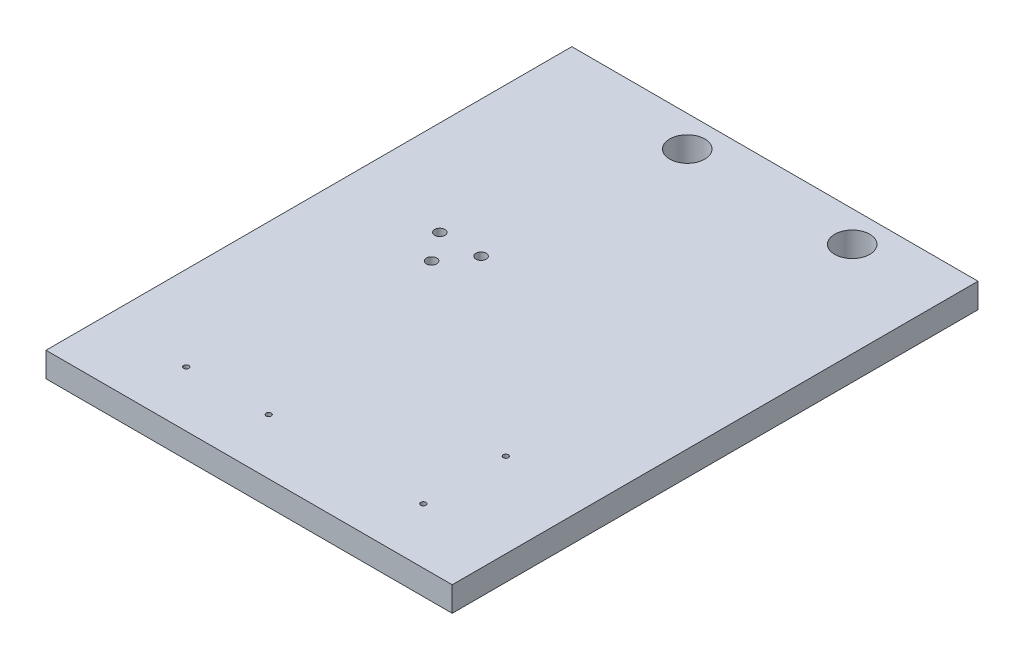
ISO-10303-21;
HEADER;
FILE_DESCRIPTION(('STEP AP214'),'2;1');
FILE_NAME('part.step','',(''),(''),'','','');
FILE_SCHEMA(('AUTOMOTIVE_DESIGN { 1 0 10303 214 1 1 1 1 }'));
ENDSEC;
DATA;
#1=APPLICATION_CONTEXT('core data for automotive mechanical design processes');
#2=APPLICATION_PROTOCOL_DEFINITION('international standard','automotive_design',2000,#1);
#3=PRODUCT_CONTEXT('',#1,'mechanical');
#4=PRODUCT('Part','Part','',(#3));
#5=PRODUCT_RELATED_PRODUCT_CATEGORY('part','',(#4));
#6=PRODUCT_DEFINITION_FORMATION('','',#4);
#7=PRODUCT_DEFINITION_CONTEXT('part definition',#1,'design');
#8=PRODUCT_DEFINITION('design','',#6,#7);
#9=PRODUCT_DEFINITION_SHAPE('','',#8);
#10=(LENGTH_UNIT() NAMED_UNIT(*) SI_UNIT(.MILLI.,.METRE.));
#11=(NAMED_UNIT(*) PLANE_ANGLE_UNIT() SI_UNIT($,.RADIAN.));
#12=(NAMED_UNIT(*) SI_UNIT($,.STERADIAN.) SOLID_ANGLE_UNIT());
#13=UNCERTAINTY_MEASURE_WITH_UNIT(LENGTH_MEASURE(1.E-05),#10,'distance_accuracy_value','');
#14=(GEOMETRIC_REPRESENTATION_CONTEXT(3) GLOBAL_UNCERTAINTY_ASSIGNED_CONTEXT((#13)) GLOBAL_UNIT_ASSIGNED_CONTEXT((#10,
#11,#12)) REPRESENTATION_CONTEXT('',''));
#15=CARTESIAN_POINT('',(0.,0.,0.));
#16=DIRECTION('',(0.,0.,1.));
#17=DIRECTION('',(1.,0.,0.));
#18=AXIS2_PLACEMENT_3D('',#15,#16,#17);
#19=CARTESIAN_POINT('',(57.5,5.99999999997181,100.5));
#20=DIRECTION('',(0.,1.,0.));
#21=DIRECTION('',(0.,0.,1.));
#22=AXIS2_PLACEMENT_3D('',#19,#20,#21);
#23=CONICAL_SURFACE('',#22,1.24999999995953,1.0297442586752);
#24=CARTESIAN_POINT('',(57.5,6.,100.5));
#25=DIRECTION('',(0.,1.,0.));
#26=DIRECTION('',(0.,0.,1.));
#27=AXIS2_PLACEMENT_3D('',#24,#25,#26);
#28=CIRCLE('',#27,1.25);
#29=CARTESIAN_POINT('',(56.2500000000085,6.00000000000716,100.5));
#30=VERTEX_POINT('',#29);
#31=CARTESIAN_POINT('',(58.7499999999937,6.00000000000716,100.5));
#32=VERTEX_POINT('',#31);
#33=EDGE_CURVE('E120',#30,#32,#28,.T.);
#34=ORIENTED_EDGE('',*,*,#33,.T.);
#35=DIRECTION('',(-0.857167300703835,-0.515038074907187,0.));
#36=VECTOR('',#35,1.);
#37=CARTESIAN_POINT('',(498957.,299774.311324496,100.500000000031));
#38=LINE('',#37,#36);
#39=CARTESIAN_POINT('',(57.4999999999761,5.24892422626522,100.5));
#40=VERTEX_POINT('',#39);
#41=EDGE_CURVE('E113',#32,#40,#38,.T.);
#42=ORIENTED_EDGE('',*,*,#41,.T.);
#43=DIRECTION('',(0.857167300703835,-0.515038074907187,0.));
#44=VECTOR('',#43,1.);
#45=CARTESIAN_POINT('',(-498842.,299774.311324496,100.499999999908));
#46=LINE('',#45,#44);
#47=EDGE_CURVE('E110',#40,#30,#46,.F.);
#48=ORIENTED_EDGE('',*,*,#47,.T.);
#49=EDGE_LOOP('',(#34,#42,#48));
#50=FACE_BOUND('',#49,.T.);
#51=ADVANCED_FACE('F17',(#50),#23,.F.);
#52=CARTESIAN_POINT('',(57.5,6.00000000002865,100.5));
#53=DIRECTION('',(0.,1.,0.));
#54=DIRECTION('',(0.,0.,1.));
#55=AXIS2_PLACEMENT_3D('',#52,#53,#54);
#56=CONICAL_SURFACE('',#55,1.24999999998135,1.02974425866186);
#57=ORIENTED_EDGE('',*,*,#47,.F.);
#58=ORIENTED_EDGE('',*,*,#41,.F.);
#59=CARTESIAN_POINT('',(57.5,6.,100.5));
#60=DIRECTION('',(0.,1.,0.));
#61=DIRECTION('',(0.,0.,1.));
#62=AXIS2_PLACEMENT_3D('',#59,#60,#61);
#63=CIRCLE('',#62,1.25);
#64=EDGE_CURVE('E116',#32,#30,#63,.T.);
#65=ORIENTED_EDGE('',*,*,#64,.T.);
#66=EDGE_LOOP('',(#57,#58,#65));
#67=FACE_BOUND('',#66,.T.);
#68=ADVANCED_FACE('F112',(#67),#56,.F.);
#69=CARTESIAN_POINT('',(-17.5,5.99999999997181,100.5));
#70=DIRECTION('',(0.,1.,0.));
#71=DIRECTION('',(0.,0.,1.));
#72=AXIS2_PLACEMENT_3D('',#69,#70,#71);
#73=CONICAL_SURFACE('',#72,1.24999999995953,1.0297442586752);
#74=CARTESIAN_POINT('',(-17.5,6.,100.5));
#75=DIRECTION('',(0.,1.,0.));
#76=DIRECTION('',(0.,0.,1.));
#77=AXIS2_PLACEMENT_3D('',#74,#75,#76);
#78=CIRCLE('',#77,1.25);
#79=CARTESIAN_POINT('',(-18.7499999999886,6.00000000000716,100.5));
#80=VERTEX_POINT('',#79);
#81=CARTESIAN_POINT('',(-16.2500000000034,6.00000000000716,100.5));
#82=VERTEX_POINT('',#81);
#83=EDGE_CURVE('E247',#80,#82,#78,.T.);
#84=ORIENTED_EDGE('',*,*,#83,.T.);
#85=DIRECTION('',(-0.857167300703835,-0.515038074907187,0.));
#86=VECTOR('',#85,1.);
#87=CARTESIAN_POINT('',(498882.,299774.311324496,100.500000000031));
#88=LINE('',#87,#86);
#89=CARTESIAN_POINT('',(-17.5000000000125,5.24892422626522,100.5));
#90=VERTEX_POINT('',#89);
#91=EDGE_CURVE('E118',#82,#90,#88,.T.);
#92=ORIENTED_EDGE('',*,*,#91,.T.);
#93=DIRECTION('',(0.857167300703835,-0.515038074907187,0.));
#94=VECTOR('',#93,1.);
#95=CARTESIAN_POINT('',(-498917.,299774.311324496,100.499999999908));
#96=LINE('',#95,#94);
#97=EDGE_CURVE('E244',#90,#80,#96,.F.);
#98=ORIENTED_EDGE('',*,*,#97,.T.);
#99=EDGE_LOOP('',(#84,#92,#98));
#100=FACE_BOUND('',#99,.T.);
#101=ADVANCED_FACE('F270',(#100),#73,.F.);
#102=CARTESIAN_POINT('',(-17.5,6.00000000002865,100.5));
#103=DIRECTION('',(0.,1.,0.));
#104=DIRECTION('',(0.,0.,1.));
#105=AXIS2_PLACEMENT_3D('',#102,#103,#104);
#106=CONICAL_SURFACE('',#105,1.24999999998135,1.02974425866186);
#107=ORIENTED_EDGE('',*,*,#97,.F.);
#108=ORIENTED_EDGE('',*,*,#91,.F.);
#109=CARTESIAN_POINT('',(-17.5,6.,100.5));
#110=DIRECTION('',(0.,1.,0.));
#111=DIRECTION('',(0.,0.,1.));
#112=AXIS2_PLACEMENT_3D('',#109,#110,#111);
#113=CIRCLE('',#112,1.25);
#114=EDGE_CURVE('E230',#82,#80,#113,.T.);
#115=ORIENTED_EDGE('',*,*,#114,.T.);
#116=EDGE_LOOP('',(#107,#108,#115));
#117=FACE_BOUND('',#116,.T.);
#118=ADVANCED_FACE('F273',(#117),#106,.F.);
#119=CARTESIAN_POINT('',(57.5,5.99999999991496,60.5));
#120=DIRECTION('',(0.,1.,0.));
#121=DIRECTION('',(-1.,0.,0.));
#122=AXIS2_PLACEMENT_3D('',#119,#120,#121);
#123=CONICAL_SURFACE('',#122,1.24999999975262,1.02974425843444);
#124=CARTESIAN_POINT('',(57.5,6.,60.5));
#125=DIRECTION('',(0.,1.,0.));
#126=DIRECTION('',(0.,0.,1.));
#127=AXIS2_PLACEMENT_3D('',#124,#125,#126);
#128=CIRCLE('',#127,1.25);
#129=CARTESIAN_POINT('',(56.2500000000512,5.99999999997874,60.5));
#130=VERTEX_POINT('',#129);
#131=CARTESIAN_POINT('',(58.7499999999227,5.99999999996453,60.5));
#132=VERTEX_POINT('',#131);
#133=EDGE_CURVE('E227',#130,#132,#128,.T.);
#134=ORIENTED_EDGE('',*,*,#133,.T.);
#135=DIRECTION('',(-0.857167300703836,-0.515038074907186,0.));
#136=VECTOR('',#135,1.);
#137=CARTESIAN_POINT('',(498997.,299798.345749255,60.5000000000305));
#138=LINE('',#137,#136);
#139=CARTESIAN_POINT('',(57.5000000002319,5.24892422615153,60.5));
#140=VERTEX_POINT('',#139);
#141=EDGE_CURVE('E239',#132,#140,#138,.T.);
#142=ORIENTED_EDGE('',*,*,#141,.T.);
#143=DIRECTION('',(0.857167300703836,-0.515038074907186,0.));
#144=VECTOR('',#143,1.);
#145=CARTESIAN_POINT('',(-498882.,299798.345749255,60.4999999999083));
#146=LINE('',#145,#144);
#147=EDGE_CURVE('E224',#140,#130,#146,.F.);
#148=ORIENTED_EDGE('',*,*,#147,.T.);
#149=EDGE_LOOP('',(#134,#142,#148));
#150=FACE_BOUND('',#149,.T.);
#151=ADVANCED_FACE('F415',(#150),#123,.F.);
#152=CARTESIAN_POINT('',(57.5,5.99999999991496,60.5));
#153=DIRECTION('',(0.,1.,0.));
#154=DIRECTION('',(-1.,0.,0.));
#155=AXIS2_PLACEMENT_3D('',#152,#153,#154);
#156=CONICAL_SURFACE('',#155,1.24999999979036,1.02974425838754);
#157=ORIENTED_EDGE('',*,*,#147,.F.);
#158=ORIENTED_EDGE('',*,*,#141,.F.);
#159=CARTESIAN_POINT('',(57.5,6.,60.5));
#160=DIRECTION('',(0.,1.,0.));
#161=DIRECTION('',(0.,0.,1.));
#162=AXIS2_PLACEMENT_3D('',#159,#160,#161);
#163=CIRCLE('',#162,1.25);
#164=EDGE_CURVE('E210',#132,#130,#163,.T.);
#165=ORIENTED_EDGE('',*,*,#164,.T.);
#166=EDGE_LOOP('',(#157,#158,#165));
#167=FACE_BOUND('',#166,.T.);
#168=ADVANCED_FACE('F411',(#167),#156,.F.);
#169=CARTESIAN_POINT('',(-57.5,5.99999999997181,100.5));
#170=DIRECTION('',(0.,1.,0.));
#171=DIRECTION('',(0.,0.,1.));
#172=AXIS2_PLACEMENT_3D('',#169,#170,#171);
#173=CONICAL_SURFACE('',#172,1.24999999995953,1.0297442586752);
#174=CARTESIAN_POINT('',(-57.5,6.,100.5));
#175=DIRECTION('',(0.,1.,0.));
#176=DIRECTION('',(0.,0.,1.));
#177=AXIS2_PLACEMENT_3D('',#174,#175,#176);
#178=CIRCLE('',#177,1.25);
#179=CARTESIAN_POINT('',(-58.7499999999937,6.00000000000716,100.5));
#180=VERTEX_POINT('',#179);
#181=CARTESIAN_POINT('',(-56.2500000000085,6.00000000000716,100.5));
#182=VERTEX_POINT('',#181);
#183=EDGE_CURVE('E207',#180,#182,#178,.T.);
#184=ORIENTED_EDGE('',*,*,#183,.T.);
#185=DIRECTION('',(-0.857167300703835,-0.515038074907187,0.));
#186=VECTOR('',#185,1.);
#187=CARTESIAN_POINT('',(498842.,299774.311324496,100.500000000031));
#188=LINE('',#187,#186);
#189=CARTESIAN_POINT('',(-57.500000000033,5.24892422626522,100.5));
#190=VERTEX_POINT('',#189);
#191=EDGE_CURVE('E219',#182,#190,#188,.T.);
#192=ORIENTED_EDGE('',*,*,#191,.T.);
#193=DIRECTION('',(0.857167300703835,-0.515038074907187,0.));
#194=VECTOR('',#193,1.);
#195=CARTESIAN_POINT('',(-498957.,299774.311324496,100.499999999908));
#196=LINE('',#195,#194);
#197=EDGE_CURVE('E204',#190,#180,#196,.F.);
#198=ORIENTED_EDGE('',*,*,#197,.T.);
#199=EDGE_LOOP('',(#184,#192,#198));
#200=FACE_BOUND('',#199,.T.);
#201=ADVANCED_FACE('F407',(#200),#173,.F.);
#202=CARTESIAN_POINT('',(-57.5,6.00000000002865,100.5));
#203=DIRECTION('',(0.,1.,0.));
#204=DIRECTION('',(0.,0.,1.));
#205=AXIS2_PLACEMENT_3D('',#202,#203,#204);
#206=CONICAL_SURFACE('',#205,1.24999999998135,1.02974425866186);
#207=ORIENTED_EDGE('',*,*,#197,.F.);
#208=ORIENTED_EDGE('',*,*,#191,.F.);
#209=CARTESIAN_POINT('',(-57.5,6.,100.5));
#210=DIRECTION('',(0.,1.,0.));
#211=DIRECTION('',(0.,0.,1.));
#212=AXIS2_PLACEMENT_3D('',#209,#210,#211);
#213=CIRCLE('',#212,1.25);
#214=EDGE_CURVE('E190',#182,#180,#213,.T.);
#215=ORIENTED_EDGE('',*,*,#214,.T.);
#216=EDGE_LOOP('',(#207,#208,#215));
#217=FACE_BOUND('',#216,.T.);
#218=ADVANCED_FACE('F403',(#217),#206,.F.);
#219=CARTESIAN_POINT('',(-32.5,7.00000000006185,-17.5));
#220=DIRECTION('',(0.,1.,0.));
#221=DIRECTION('',(0.,0.,1.));
#222=AXIS2_PLACEMENT_3D('',#219,#220,#221);
#223=CONICAL_SURFACE('',#222,2.5000000000955,1.02974425867857);
#224=CARTESIAN_POINT('',(-32.5,7.,-17.5));
#225=DIRECTION('',(0.,1.,0.));
#226=DIRECTION('',(0.,0.,1.));
#227=AXIS2_PLACEMENT_3D('',#224,#225,#226);
#228=CIRCLE('',#227,2.5);
#229=CARTESIAN_POINT('',(-35.0000000000063,7.00000000001546,-17.5));
#230=VERTEX_POINT('',#229);
#231=CARTESIAN_POINT('',(-29.9999999999932,7.00000000001546,-17.5));
#232=VERTEX_POINT('',#231);
#233=EDGE_CURVE('E187',#230,#232,#228,.T.);
#234=ORIENTED_EDGE('',*,*,#233,.T.);
#235=DIRECTION('',(-0.857167300703835,-0.515038074907187,0.));
#236=VECTOR('',#235,1.);
#237=CARTESIAN_POINT('',(498985.,299845.461801766,-17.4999999999695));
#238=LINE('',#237,#236);
#239=CARTESIAN_POINT('',(-32.5000000000557,5.49784845250656,-17.5));
#240=VERTEX_POINT('',#239);
#241=EDGE_CURVE('E199',#232,#240,#238,.T.);
#242=ORIENTED_EDGE('',*,*,#241,.T.);
#243=DIRECTION('',(0.857167300703835,-0.515038074907187,0.));
#244=VECTOR('',#243,1.);
#245=CARTESIAN_POINT('',(-499050.,299845.461801766,-17.5000000000917));
#246=LINE('',#245,#244);
#247=EDGE_CURVE('E184',#240,#230,#246,.F.);
#248=ORIENTED_EDGE('',*,*,#247,.T.);
#249=EDGE_LOOP('',(#234,#242,#248));
#250=FACE_BOUND('',#249,.T.);
#251=ADVANCED_FACE('F399',(#250),#223,.F.);
#252=CARTESIAN_POINT('',(-32.5,7.00000000017553,-17.5));
#253=DIRECTION('',(0.,1.,0.));
#254=DIRECTION('',(0.,0.,1.));
#255=AXIS2_PLACEMENT_3D('',#252,#253,#254);
#256=CONICAL_SURFACE('',#255,2.50000000018417,1.02974425866419);
#257=ORIENTED_EDGE('',*,*,#247,.F.);
#258=ORIENTED_EDGE('',*,*,#241,.F.);
#259=CARTESIAN_POINT('',(-32.5,7.,-17.5));
#260=DIRECTION('',(0.,1.,0.));
#261=DIRECTION('',(0.,0.,1.));
#262=AXIS2_PLACEMENT_3D('',#259,#260,#261);
#263=CIRCLE('',#262,2.5);
#264=EDGE_CURVE('E169',#232,#230,#263,.T.);
#265=ORIENTED_EDGE('',*,*,#264,.T.);
#266=EDGE_LOOP('',(#257,#258,#265));
#267=FACE_BOUND('',#266,.T.);
#268=ADVANCED_FACE('F395',(#267),#256,.F.);
#269=CARTESIAN_POINT('',(-52.5,7.00000000006185,-17.5));
#270=DIRECTION('',(0.,1.,0.));
#271=DIRECTION('',(0.,0.,1.));
#272=AXIS2_PLACEMENT_3D('',#269,#270,#271);
#273=CONICAL_SURFACE('',#272,2.5000000000955,1.02974425867857);
#274=CARTESIAN_POINT('',(-52.5,7.,-17.5));
#275=DIRECTION('',(0.,1.,0.));
#276=DIRECTION('',(0.,0.,1.));
#277=AXIS2_PLACEMENT_3D('',#274,#275,#276);
#278=CIRCLE('',#277,2.5);
#279=CARTESIAN_POINT('',(-55.0000000000017,7.00000000001546,-17.5));
#280=VERTEX_POINT('',#279);
#281=CARTESIAN_POINT('',(-50.0000000000028,7.00000000001546,-17.5));
#282=VERTEX_POINT('',#281);
#283=EDGE_CURVE('E164',#280,#282,#278,.T.);
#284=ORIENTED_EDGE('',*,*,#283,.T.);
#285=DIRECTION('',(-0.857167300703835,-0.515038074907187,0.));
#286=VECTOR('',#285,1.);
#287=CARTESIAN_POINT('',(498965.,299845.461801766,-17.4999999999694));
#288=LINE('',#287,#286);
#289=CARTESIAN_POINT('',(-52.5000000000659,5.49784845250656,-17.5));
#290=VERTEX_POINT('',#289);
#291=EDGE_CURVE('E179',#282,#290,#288,.T.);
#292=ORIENTED_EDGE('',*,*,#291,.T.);
#293=DIRECTION('',(0.857167300703835,-0.515038074907187,0.));
#294=VECTOR('',#293,1.);
#295=CARTESIAN_POINT('',(-499070.,299845.461801766,-17.5000000000917));
#296=LINE('',#295,#294);
#297=EDGE_CURVE('E176',#290,#280,#296,.F.);
#298=ORIENTED_EDGE('',*,*,#297,.T.);
#299=EDGE_LOOP('',(#284,#292,#298));
#300=FACE_BOUND('',#299,.T.);
#301=ADVANCED_FACE('F392',(#300),#273,.F.);
#302=CARTESIAN_POINT('',(-52.5,7.00000000006185,-17.5));
#303=DIRECTION('',(0.,1.,0.));
#304=DIRECTION('',(0.,0.,1.));
#305=AXIS2_PLACEMENT_3D('',#302,#303,#304);
#306=CONICAL_SURFACE('',#305,2.50000000001364,1.02974425866749);
#307=ORIENTED_EDGE('',*,*,#297,.F.);
#308=ORIENTED_EDGE('',*,*,#291,.F.);
#309=CARTESIAN_POINT('',(-52.5,7.,-17.5));
#310=DIRECTION('',(0.,1.,0.));
#311=DIRECTION('',(0.,0.,1.));
#312=AXIS2_PLACEMENT_3D('',#309,#310,#311);
#313=CIRCLE('',#312,2.5);
#314=EDGE_CURVE('E160',#282,#280,#313,.T.);
#315=ORIENTED_EDGE('',*,*,#314,.T.);
#316=EDGE_LOOP('',(#307,#308,#315));
#317=FACE_BOUND('',#316,.T.);
#318=ADVANCED_FACE('F389',(#317),#306,.F.);
#319=CARTESIAN_POINT('',(-42.5,7.,-3.5));
#320=DIRECTION('',(0.,-1.,0.));
#321=DIRECTION('',(0.,0.,-1.));
#322=AXIS2_PLACEMENT_3D('',#319,#320,#321);
#323=PLANE('',#322);
#324=CARTESIAN_POINT('',(-42.5,7.,-3.5));
#325=DIRECTION('',(0.,-1.,0.));
#326=DIRECTION('',(0.,0.,-1.));
#327=AXIS2_PLACEMENT_3D('',#324,#325,#326);
#328=CIRCLE('',#327,2.5);
#329=CARTESIAN_POINT('',(-42.5,7.,-6.));
#330=VERTEX_POINT('',#329);
#331=EDGE_CURVE('E20',#330,#330,#328,.F.);
#332=ORIENTED_EDGE('',*,*,#331,.T.);
#333=EDGE_LOOP('',(#332));
#334=FACE_BOUND('',#333,.T.);
#335=ADVANCED_FACE('F385',(#334),#323,.F.);
#336=CARTESIAN_POINT('',(57.5,4.91137043753,100.5));
#337=DIRECTION('',(0.,1.,0.));
#338=DIRECTION('',(0.,0.,1.));
#339=AXIS2_PLACEMENT_3D('',#336,#337,#338);
#340=CYLINDRICAL_SURFACE('',#339,1.25);
#341=ORIENTED_EDGE('',*,*,#64,.F.);
#342=ORIENTED_EDGE('',*,*,#33,.F.);
#343=EDGE_LOOP('',(#341,#342));
#344=FACE_BOUND('',#343,.T.);
#345=CARTESIAN_POINT('',(57.5,12.,100.5));
#346=DIRECTION('',(0.,1.,0.));
#347=DIRECTION('',(0.,0.,1.));
#348=AXIS2_PLACEMENT_3D('',#345,#346,#347);
#349=CIRCLE('',#348,1.25);
#350=CARTESIAN_POINT('',(57.5,12.,101.75));
#351=VERTEX_POINT('',#350);
#352=EDGE_CURVE('E155',#351,#351,#349,.F.);
#353=ORIENTED_EDGE('',*,*,#352,.F.);
#354=EDGE_LOOP('',(#353));
#355=FACE_BOUND('',#354,.T.);
#356=ADVANCED_FACE('F279',(#344,#355),#340,.F.);
#357=CARTESIAN_POINT('',(-17.5,4.91137043753,100.5));
#358=DIRECTION('',(0.,1.,0.));
#359=DIRECTION('',(0.,0.,1.));
#360=AXIS2_PLACEMENT_3D('',#357,#358,#359);
#361=CYLINDRICAL_SURFACE('',#360,1.25);
#362=ORIENTED_EDGE('',*,*,#114,.F.);
#363=ORIENTED_EDGE('',*,*,#83,.F.);
#364=EDGE_LOOP('',(#362,#363));
#365=FACE_BOUND('',#364,.T.);
#366=CARTESIAN_POINT('',(-17.5,12.,100.5));
#367=DIRECTION('',(0.,1.,0.));
#368=DIRECTION('',(0.,0.,1.));
#369=AXIS2_PLACEMENT_3D('',#366,#367,#368);
#370=CIRCLE('',#369,1.25);
#371=CARTESIAN_POINT('',(-17.5,12.,101.75));
#372=VERTEX_POINT('',#371);
#373=EDGE_CURVE('E153',#372,#372,#370,.F.);
#374=ORIENTED_EDGE('',*,*,#373,.F.);
#375=EDGE_LOOP('',(#374));
#376=FACE_BOUND('',#375,.T.);
#377=ADVANCED_FACE('F275',(#365,#376),#361,.F.);
#378=CARTESIAN_POINT('',(57.5,4.91137043753,60.5));
#379=DIRECTION('',(0.,1.,0.));
#380=DIRECTION('',(0.,0.,1.));
#381=AXIS2_PLACEMENT_3D('',#378,#379,#380);
#382=CYLINDRICAL_SURFACE('',#381,1.25);
#383=ORIENTED_EDGE('',*,*,#164,.F.);
#384=ORIENTED_EDGE('',*,*,#133,.F.);
#385=EDGE_LOOP('',(#383,#384));
#386=FACE_BOUND('',#385,.T.);
#387=CARTESIAN_POINT('',(57.5,12.,60.5));
#388=DIRECTION('',(0.,1.,0.));
#389=DIRECTION('',(0.,0.,1.));
#390=AXIS2_PLACEMENT_3D('',#387,#388,#389);
#391=CIRCLE('',#390,1.25);
#392=CARTESIAN_POINT('',(57.5,12.,61.75));
#393=VERTEX_POINT('',#392);
#394=EDGE_CURVE('E150',#393,#393,#391,.F.);
#395=ORIENTED_EDGE('',*,*,#394,.F.);
#396=EDGE_LOOP('',(#395));
#397=FACE_BOUND('',#396,.T.);
#398=ADVANCED_FACE('F278',(#386,#397),#382,.F.);
#399=CARTESIAN_POINT('',(-57.5,4.91137043753,100.5));
#400=DIRECTION('',(0.,1.,0.));
#401=DIRECTION('',(0.,0.,1.));
#402=AXIS2_PLACEMENT_3D('',#399,#400,#401);
#403=CYLINDRICAL_SURFACE('',#402,1.25);
#404=ORIENTED_EDGE('',*,*,#214,.F.);
#405=ORIENTED_EDGE('',*,*,#183,.F.);
#406=EDGE_LOOP('',(#404,#405));
#407=FACE_BOUND('',#406,.T.);
#408=CARTESIAN_POINT('',(-57.5,12.,100.5));
#409=DIRECTION('',(0.,1.,0.));
#410=DIRECTION('',(0.,0.,1.));
#411=AXIS2_PLACEMENT_3D('',#408,#409,#410);
#412=CIRCLE('',#411,1.25);
#413=CARTESIAN_POINT('',(-57.5,12.,101.75));
#414=VERTEX_POINT('',#413);
#415=EDGE_CURVE('E147',#414,#414,#412,.F.);
#416=ORIENTED_EDGE('',*,*,#415,.F.);
#417=EDGE_LOOP('',(#416));
#418=FACE_BOUND('',#417,.T.);
#419=ADVANCED_FACE('F371',(#407,#418),#403,.F.);
#420=CARTESIAN_POINT('',(-32.5,4.92274087505,-17.5));
#421=DIRECTION('',(0.,1.,0.));
#422=DIRECTION('',(0.,0.,1.));
#423=AXIS2_PLACEMENT_3D('',#420,#421,#422);
#424=CYLINDRICAL_SURFACE('',#423,2.5);
#425=ORIENTED_EDGE('',*,*,#264,.F.);
#426=ORIENTED_EDGE('',*,*,#233,.F.);
#427=EDGE_LOOP('',(#425,#426));
#428=FACE_BOUND('',#427,.T.);
#429=CARTESIAN_POINT('',(-32.5,12.,-17.5));
#430=DIRECTION('',(0.,1.,0.));
#431=DIRECTION('',(0.,0.,1.));
#432=AXIS2_PLACEMENT_3D('',#429,#430,#431);
#433=CIRCLE('',#432,2.5);
#434=CARTESIAN_POINT('',(-32.5,12.,-15.));
#435=VERTEX_POINT('',#434);
#436=EDGE_CURVE('E144',#435,#435,#433,.F.);
#437=ORIENTED_EDGE('',*,*,#436,.F.);
#438=EDGE_LOOP('',(#437));
#439=FACE_BOUND('',#438,.T.);
#440=ADVANCED_FACE('F377',(#428,#439),#424,.F.);
#441=CARTESIAN_POINT('',(-52.5,4.92274087505,-17.5));
#442=DIRECTION('',(0.,1.,0.));
#443=DIRECTION('',(0.,0.,1.));
#444=AXIS2_PLACEMENT_3D('',#441,#442,#443);
#445=CYLINDRICAL_SURFACE('',#444,2.5);
#446=ORIENTED_EDGE('',*,*,#314,.F.);
#447=ORIENTED_EDGE('',*,*,#283,.F.);
#448=EDGE_LOOP('',(#446,#447));
#449=FACE_BOUND('',#448,.T.);
#450=CARTESIAN_POINT('',(-52.5,12.,-17.5));
#451=DIRECTION('',(0.,1.,0.));
#452=DIRECTION('',(0.,0.,1.));
#453=AXIS2_PLACEMENT_3D('',#450,#451,#452);
#454=CIRCLE('',#453,2.5);
#455=CARTESIAN_POINT('',(-52.5,12.,-15.));
#456=VERTEX_POINT('',#455);
#457=EDGE_CURVE('E141',#456,#456,#454,.F.);
#458=ORIENTED_EDGE('',*,*,#457,.F.);
#459=EDGE_LOOP('',(#458));
#460=FACE_BOUND('',#459,.T.);
#461=ADVANCED_FACE('F535',(#449,#460),#445,.F.);
#462=CARTESIAN_POINT('',(-42.5,27.,-3.5));
#463=DIRECTION('',(0.,-1.,0.));
#464=DIRECTION('',(0.,0.,-1.));
#465=AXIS2_PLACEMENT_3D('',#462,#463,#464);
#466=CYLINDRICAL_SURFACE('',#465,2.5);
#467=ORIENTED_EDGE('',*,*,#331,.F.);
#468=EDGE_LOOP('',(#467));
#469=FACE_BOUND('',#468,.T.);
#470=CARTESIAN_POINT('',(-42.5,12.,-3.5));
#471=DIRECTION('',(0.,-1.,0.));
#472=DIRECTION('',(0.,0.,-1.));
#473=AXIS2_PLACEMENT_3D('',#470,#471,#472);
#474=CIRCLE('',#473,2.5);
#475=CARTESIAN_POINT('',(-42.5,12.,-6.));
#476=VERTEX_POINT('',#475);
#477=EDGE_CURVE('E137',#476,#476,#474,.T.);
#478=ORIENTED_EDGE('',*,*,#477,.F.);
#479=EDGE_LOOP('',(#478));
#480=FACE_BOUND('',#479,.T.);
#481=ADVANCED_FACE('F286',(#469,#480),#466,.F.);
#482=CARTESIAN_POINT('',(0.,12.,0.));
#483=DIRECTION('',(0.,1.,0.));
#484=DIRECTION('',(0.,0.,1.));
#485=AXIS2_PLACEMENT_3D('',#482,#483,#484);
#486=PLANE('',#485);
#487=ORIENTED_EDGE('',*,*,#477,.T.);
#488=EDGE_LOOP('',(#487));
#489=FACE_BOUND('',#488,.T.);
#490=CARTESIAN_POINT('',(52.5,12.,-112.5));
#491=DIRECTION('',(0.,1.,0.));
#492=DIRECTION('',(0.,0.,1.));
#493=AXIS2_PLACEMENT_3D('',#490,#491,#492);
#494=CIRCLE('',#493,8.5);
#495=CARTESIAN_POINT('',(52.5,12.,-104.));
#496=VERTEX_POINT('',#495);
#497=EDGE_CURVE('E130',#496,#496,#494,.F.);
#498=ORIENTED_EDGE('',*,*,#497,.T.);
#499=EDGE_LOOP('',(#498));
#500=FACE_BOUND('',#499,.T.);
#501=CARTESIAN_POINT('',(-27.5,12.,-112.5));
#502=DIRECTION('',(0.,-1.,0.));
#503=DIRECTION('',(0.,0.,-1.));
#504=AXIS2_PLACEMENT_3D('',#501,#502,#503);
#505=CIRCLE('',#504,8.5);
#506=CARTESIAN_POINT('',(-27.5,12.,-121.));
#507=VERTEX_POINT('',#506);
#508=EDGE_CURVE('E134',#507,#507,#505,.T.);
#509=ORIENTED_EDGE('',*,*,#508,.T.);
#510=EDGE_LOOP('',(#509));
#511=FACE_BOUND('',#510,.T.);
#512=ORIENTED_EDGE('',*,*,#457,.T.);
#513=EDGE_LOOP('',(#512));
#514=FACE_BOUND('',#513,.T.);
#515=ORIENTED_EDGE('',*,*,#436,.T.);
#516=EDGE_LOOP('',(#515));
#517=FACE_BOUND('',#516,.T.);
#518=ORIENTED_EDGE('',*,*,#415,.T.);
#519=EDGE_LOOP('',(#518));
#520=FACE_BOUND('',#519,.T.);
#521=ORIENTED_EDGE('',*,*,#394,.T.);
#522=EDGE_LOOP('',(#521));
#523=FACE_BOUND('',#522,.T.);
#524=ORIENTED_EDGE('',*,*,#373,.T.);
#525=EDGE_LOOP('',(#524));
#526=FACE_BOUND('',#525,.T.);
#527=ORIENTED_EDGE('',*,*,#352,.T.);
#528=EDGE_LOOP('',(#527));
#529=FACE_BOUND('',#528,.T.);
#530=DIRECTION('',(-1.,0.,0.));
#531=VECTOR('',#530,1.);
#532=CARTESIAN_POINT('',(98.5,12.,-127.5));
#533=LINE('',#532,#531);
#534=CARTESIAN_POINT('',(-98.5,12.,-127.5));
#535=VERTEX_POINT('',#534);
#536=CARTESIAN_POINT('',(98.5,12.,-127.5));
#537=VERTEX_POINT('',#536);
#538=EDGE_CURVE('E293',#535,#537,#533,.F.);
#539=ORIENTED_EDGE('',*,*,#538,.F.);
#540=DIRECTION('',(0.,0.,1.));
#541=VECTOR('',#540,1.);
#542=CARTESIAN_POINT('',(-98.5,12.,-127.5));
#543=LINE('',#542,#541);
#544=CARTESIAN_POINT('',(-98.5,12.,127.5));
#545=VERTEX_POINT('',#544);
#546=EDGE_CURVE('E140',#545,#535,#543,.F.);
#547=ORIENTED_EDGE('',*,*,#546,.F.);
#548=DIRECTION('',(1.,0.,0.));
#549=VECTOR('',#548,1.);
#550=CARTESIAN_POINT('',(-98.5,12.,127.5));
#551=LINE('',#550,#549);
#552=CARTESIAN_POINT('',(98.5,12.,127.5));
#553=VERTEX_POINT('',#552);
#554=EDGE_CURVE('E309',#553,#545,#551,.F.);
#555=ORIENTED_EDGE('',*,*,#554,.F.);
#556=DIRECTION('',(0.,0.,-1.));
#557=VECTOR('',#556,1.);
#558=CARTESIAN_POINT('',(98.5,12.,127.5));
#559=LINE('',#558,#557);
#560=EDGE_CURVE('E296',#537,#553,#559,.F.);
#561=ORIENTED_EDGE('',*,*,#560,.F.);
#562=EDGE_LOOP('',(#539,#547,#555,#561));
#563=FACE_BOUND('',#562,.T.);
#564=ADVANCED_FACE('F283',(#489,#500,#511,#514,#517,#520,#523,#526,#529,#563),#486,.T.);
#565=CARTESIAN_POINT('',(-98.5,0.,-127.5));
#566=DIRECTION('',(-1.,0.,0.));
#567=DIRECTION('',(0.,0.,1.));
#568=AXIS2_PLACEMENT_3D('',#565,#566,#567);
#569=PLANE('',#568);
#570=DIRECTION('',(0.,1.,0.));
#571=VECTOR('',#570,1.);
#572=CARTESIAN_POINT('',(-98.5,0.,-127.5));
#573=LINE('',#572,#571);
#574=CARTESIAN_POINT('',(-98.5,0.,-127.5));
#575=VERTEX_POINT('',#574);
#576=EDGE_CURVE('E298',#575,#535,#573,.T.);
#577=ORIENTED_EDGE('',*,*,#576,.F.);
#578=DIRECTION('',(0.,0.,1.));
#579=VECTOR('',#578,1.);
#580=CARTESIAN_POINT('',(-98.5,0.,0.));
#581=LINE('',#580,#579);
#582=CARTESIAN_POINT('',(-98.5,0.,127.5));
#583=VERTEX_POINT('',#582);
#584=EDGE_CURVE('E133',#575,#583,#581,.T.);
#585=ORIENTED_EDGE('',*,*,#584,.T.);
#586=DIRECTION('',(0.,1.,0.));
#587=VECTOR('',#586,1.);
#588=CARTESIAN_POINT('',(-98.5,0.,127.5));
#589=LINE('',#588,#587);
#590=EDGE_CURVE('E307',#545,#583,#589,.F.);
#591=ORIENTED_EDGE('',*,*,#590,.F.);
#592=ORIENTED_EDGE('',*,*,#546,.T.);
#593=EDGE_LOOP('',(#577,#585,#591,#592));
#594=FACE_BOUND('',#593,.T.);
#595=ADVANCED_FACE('F285',(#594),#569,.T.);
#596=CARTESIAN_POINT('',(-98.5,0.,127.5));
#597=DIRECTION('',(0.,0.,1.));
#598=DIRECTION('',(1.,0.,0.));
#599=AXIS2_PLACEMENT_3D('',#596,#597,#598);
#600=PLANE('',#599);
#601=ORIENTED_EDGE('',*,*,#590,.T.);
#602=DIRECTION('',(1.,0.,0.));
#603=VECTOR('',#602,1.);
#604=CARTESIAN_POINT('',(0.,0.,127.5));
#605=LINE('',#604,#603);
#606=CARTESIAN_POINT('',(98.5,0.,127.5));
#607=VERTEX_POINT('',#606);
#608=EDGE_CURVE('E320',#583,#607,#605,.T.);
#609=ORIENTED_EDGE('',*,*,#608,.T.);
#610=DIRECTION('',(0.,1.,0.));
#611=VECTOR('',#610,1.);
#612=CARTESIAN_POINT('',(98.5,0.,127.5));
#613=LINE('',#612,#611);
#614=EDGE_CURVE('E301',#553,#607,#613,.F.);
#615=ORIENTED_EDGE('',*,*,#614,.F.);
#616=ORIENTED_EDGE('',*,*,#554,.T.);
#617=EDGE_LOOP('',(#601,#609,#615,#616));
#618=FACE_BOUND('',#617,.T.);
#619=ADVANCED_FACE('F328',(#618),#600,.T.);
#620=CARTESIAN_POINT('',(98.5,0.,127.5));
#621=DIRECTION('',(1.,0.,0.));
#622=DIRECTION('',(0.,0.,-1.));
#623=AXIS2_PLACEMENT_3D('',#620,#621,#622);
#624=PLANE('',#623);
#625=ORIENTED_EDGE('',*,*,#614,.T.);
#626=DIRECTION('',(0.,0.,1.));
#627=VECTOR('',#626,1.);
#628=CARTESIAN_POINT('',(98.5,0.,0.));
#629=LINE('',#628,#627);
#630=CARTESIAN_POINT('',(98.5,0.,-127.5));
#631=VERTEX_POINT('',#630);
#632=EDGE_CURVE('E318',#607,#631,#629,.F.);
#633=ORIENTED_EDGE('',*,*,#632,.T.);
#634=DIRECTION('',(0.,1.,0.));
#635=VECTOR('',#634,1.);
#636=CARTESIAN_POINT('',(98.5,0.,-127.5));
#637=LINE('',#636,#635);
#638=EDGE_CURVE('E35',#537,#631,#637,.F.);
#639=ORIENTED_EDGE('',*,*,#638,.F.);
#640=ORIENTED_EDGE('',*,*,#560,.T.);
#641=EDGE_LOOP('',(#625,#633,#639,#640));
#642=FACE_BOUND('',#641,.T.);
#643=ADVANCED_FACE('F330',(#642),#624,.T.);
#644=CARTESIAN_POINT('',(98.5,0.,-127.5));
#645=DIRECTION('',(0.,0.,-1.));
#646=DIRECTION('',(-1.,0.,0.));
#647=AXIS2_PLACEMENT_3D('',#644,#645,#646);
#648=PLANE('',#647);
#649=ORIENTED_EDGE('',*,*,#638,.T.);
#650=DIRECTION('',(1.,0.,0.));
#651=VECTOR('',#650,1.);
#652=CARTESIAN_POINT('',(0.,0.,-127.5));
#653=LINE('',#652,#651);
#654=EDGE_CURVE('E129',#631,#575,#653,.F.);
#655=ORIENTED_EDGE('',*,*,#654,.T.);
#656=ORIENTED_EDGE('',*,*,#576,.T.);
#657=ORIENTED_EDGE('',*,*,#538,.T.);
#658=EDGE_LOOP('',(#649,#655,#656,#657));
#659=FACE_BOUND('',#658,.T.);
#660=ADVANCED_FACE('F314',(#659),#648,.T.);
#661=CARTESIAN_POINT('',(-27.5,12.,-112.5));
#662=DIRECTION('',(0.,-1.,0.));
#663=DIRECTION('',(0.,0.,-1.));
#664=AXIS2_PLACEMENT_3D('',#661,#662,#663);
#665=CYLINDRICAL_SURFACE('',#664,8.5);
#666=ORIENTED_EDGE('',*,*,#508,.F.);
#667=EDGE_LOOP('',(#666));
#668=FACE_BOUND('',#667,.T.);
#669=CARTESIAN_POINT('',(-27.5,0.,-112.5));
#670=DIRECTION('',(0.,-1.,0.));
#671=DIRECTION('',(0.,0.,-1.));
#672=AXIS2_PLACEMENT_3D('',#669,#670,#671);
#673=CIRCLE('',#672,8.5);
#674=CARTESIAN_POINT('',(-27.5,0.,-121.));
#675=VERTEX_POINT('',#674);
#676=EDGE_CURVE('E26',#675,#675,#673,.T.);
#677=ORIENTED_EDGE('',*,*,#676,.T.);
#678=EDGE_LOOP('',(#677));
#679=FACE_BOUND('',#678,.T.);
#680=ADVANCED_FACE('F338',(#668,#679),#665,.F.);
#681=CARTESIAN_POINT('',(52.5,12.,-112.5));
#682=DIRECTION('',(0.,1.,0.));
#683=DIRECTION('',(0.,0.,1.));
#684=AXIS2_PLACEMENT_3D('',#681,#682,#683);
#685=CYLINDRICAL_SURFACE('',#684,8.5);
#686=ORIENTED_EDGE('',*,*,#497,.F.);
#687=EDGE_LOOP('',(#686));
#688=FACE_BOUND('',#687,.T.);
#689=CARTESIAN_POINT('',(52.5,0.,-112.5));
#690=DIRECTION('',(0.,1.,0.));
#691=DIRECTION('',(0.,0.,1.));
#692=AXIS2_PLACEMENT_3D('',#689,#690,#691);
#693=CIRCLE('',#692,8.5);
#694=CARTESIAN_POINT('',(52.5,0.,-104.));
#695=VERTEX_POINT('',#694);
#696=EDGE_CURVE('E11',#695,#695,#693,.F.);
#697=ORIENTED_EDGE('',*,*,#696,.T.);
#698=EDGE_LOOP('',(#697));
#699=FACE_BOUND('',#698,.T.);
#700=ADVANCED_FACE('F342',(#688,#699),#685,.F.);
#701=CARTESIAN_POINT('',(0.,0.,0.));
#702=DIRECTION('',(0.,1.,0.));
#703=DIRECTION('',(0.,0.,1.));
#704=AXIS2_PLACEMENT_3D('',#701,#702,#703);
#705=PLANE('',#704);
#706=ORIENTED_EDGE('',*,*,#696,.F.);
#707=EDGE_LOOP('',(#706));
#708=FACE_BOUND('',#707,.T.);
#709=ORIENTED_EDGE('',*,*,#676,.F.);
#710=EDGE_LOOP('',(#709));
#711=FACE_BOUND('',#710,.T.);
#712=ORIENTED_EDGE('',*,*,#632,.F.);
#713=ORIENTED_EDGE('',*,*,#608,.F.);
#714=ORIENTED_EDGE('',*,*,#584,.F.);
#715=ORIENTED_EDGE('',*,*,#654,.F.);
#716=EDGE_LOOP('',(#712,#713,#714,#715));
#717=FACE_BOUND('',#716,.T.);
#718=ADVANCED_FACE('F325',(#708,#711,#717),#705,.F.);
#719=CLOSED_SHELL('',(#51,#68,#101,#118,#151,#168,#201,#218,#251,#268,#301,#318,#335,#356,#377,
#398,#419,#440,#461,#481,#564,#595,#619,#643,#660,#680,#700,#718));
#720=MANIFOLD_SOLID_BREP('B1',#719);
#721=ADVANCED_BREP_SHAPE_REPRESENTATION('',(#18,#720),#14);
#722=SHAPE_DEFINITION_REPRESENTATION(#9,#721);
ENDSEC;
END-ISO-10303-21;
